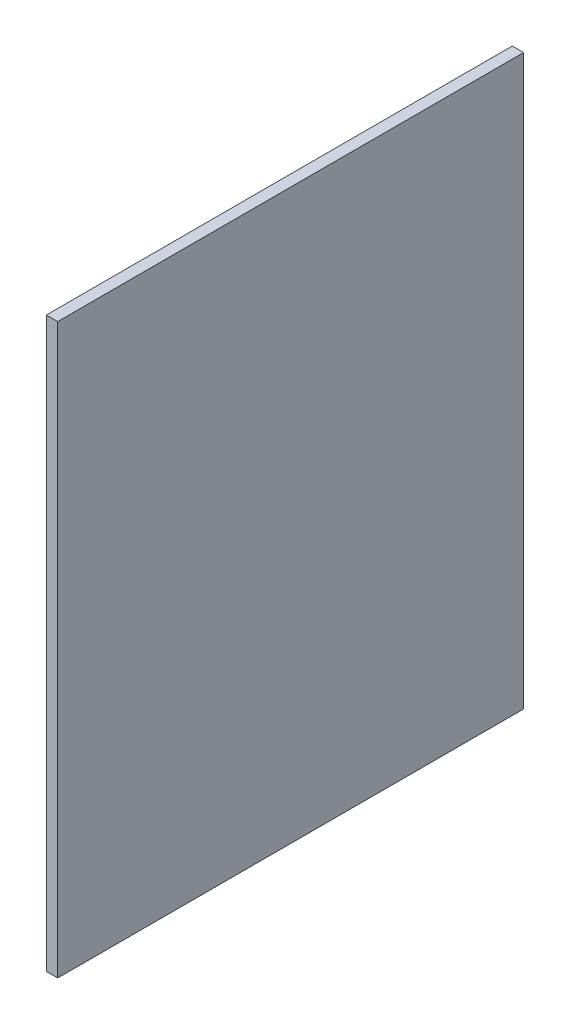
ISO-10303-21;
HEADER;
FILE_DESCRIPTION(('STEP AP214'),'2;1');
FILE_NAME('part.step','',(''),(''),'','','');
FILE_SCHEMA(('AUTOMOTIVE_DESIGN { 1 0 10303 214 1 1 1 1 }'));
ENDSEC;
DATA;
#1=APPLICATION_CONTEXT('core data for automotive mechanical design processes');
#2=APPLICATION_PROTOCOL_DEFINITION('international standard','automotive_design',2000,#1);
#3=PRODUCT_CONTEXT('',#1,'mechanical');
#4=PRODUCT('Part','Part','',(#3));
#5=PRODUCT_RELATED_PRODUCT_CATEGORY('part','',(#4));
#6=PRODUCT_DEFINITION_FORMATION('','',#4);
#7=PRODUCT_DEFINITION_CONTEXT('part definition',#1,'design');
#8=PRODUCT_DEFINITION('design','',#6,#7);
#9=PRODUCT_DEFINITION_SHAPE('','',#8);
#10=(LENGTH_UNIT() NAMED_UNIT(*) SI_UNIT(.MILLI.,.METRE.));
#11=(NAMED_UNIT(*) PLANE_ANGLE_UNIT() SI_UNIT($,.RADIAN.));
#12=(NAMED_UNIT(*) SI_UNIT($,.STERADIAN.) SOLID_ANGLE_UNIT());
#13=UNCERTAINTY_MEASURE_WITH_UNIT(LENGTH_MEASURE(1.E-05),#10,'distance_accuracy_value','');
#14=(GEOMETRIC_REPRESENTATION_CONTEXT(3) GLOBAL_UNCERTAINTY_ASSIGNED_CONTEXT((#13)) GLOBAL_UNIT_ASSIGNED_CONTEXT((#10,
#11,#12)) REPRESENTATION_CONTEXT('',''));
#15=CARTESIAN_POINT('',(0.,0.,0.));
#16=DIRECTION('',(0.,0.,1.));
#17=DIRECTION('',(1.,0.,0.));
#18=AXIS2_PLACEMENT_3D('',#15,#16,#17);
#19=CARTESIAN_POINT('',(8.75,0.,0.));
#20=DIRECTION('',(0.,0.,-1.));
#21=DIRECTION('',(-1.,0.,0.));
#22=AXIS2_PLACEMENT_3D('',#19,#20,#21);
#23=PLANE('',#22);
#24=DIRECTION('',(0.,-1.,0.));
#25=VECTOR('',#24,1.);
#26=CARTESIAN_POINT('',(0.,0.,0.));
#27=LINE('',#26,#25);
#28=CARTESIAN_POINT('',(0.,438.,0.));
#29=VERTEX_POINT('',#28);
#30=CARTESIAN_POINT('',(0.,0.,0.));
#31=VERTEX_POINT('',#30);
#32=EDGE_CURVE('E95',#29,#31,#27,.T.);
#33=ORIENTED_EDGE('',*,*,#32,.T.);
#34=DIRECTION('',(-1.,0.,0.));
#35=VECTOR('',#34,1.);
#36=CARTESIAN_POINT('',(8.75,0.,0.));
#37=LINE('',#36,#35);
#38=CARTESIAN_POINT('',(8.75,0.,0.));
#39=VERTEX_POINT('',#38);
#40=EDGE_CURVE('E11',#39,#31,#37,.T.);
#41=ORIENTED_EDGE('',*,*,#40,.F.);
#42=DIRECTION('',(0.,-1.,0.));
#43=VECTOR('',#42,1.);
#44=CARTESIAN_POINT('',(8.75,0.,0.));
#45=LINE('',#44,#43);
#46=CARTESIAN_POINT('',(8.75,438.,0.));
#47=VERTEX_POINT('',#46);
#48=EDGE_CURVE('E83',#47,#39,#45,.T.);
#49=ORIENTED_EDGE('',*,*,#48,.F.);
#50=DIRECTION('',(-1.,0.,0.));
#51=VECTOR('',#50,1.);
#52=CARTESIAN_POINT('',(8.75,438.,0.));
#53=LINE('',#52,#51);
#54=EDGE_CURVE('E91',#47,#29,#53,.T.);
#55=ORIENTED_EDGE('',*,*,#54,.T.);
#56=EDGE_LOOP('',(#33,#41,#49,#55));
#57=FACE_BOUND('',#56,.T.);
#58=ADVANCED_FACE('F32',(#57),#23,.F.);
#59=CARTESIAN_POINT('',(8.75,0.,0.));
#60=DIRECTION('',(0.,1.,0.));
#61=DIRECTION('',(0.,0.,1.));
#62=AXIS2_PLACEMENT_3D('',#59,#60,#61);
#63=PLANE('',#62);
#64=DIRECTION('',(0.,0.,-1.));
#65=VECTOR('',#64,1.);
#66=CARTESIAN_POINT('',(0.,0.,0.));
#67=LINE('',#66,#65);
#68=CARTESIAN_POINT('',(0.,0.,-359.));
#69=VERTEX_POINT('',#68);
#70=EDGE_CURVE('E87',#31,#69,#67,.T.);
#71=ORIENTED_EDGE('',*,*,#70,.T.);
#72=DIRECTION('',(-1.,0.,0.));
#73=VECTOR('',#72,1.);
#74=CARTESIAN_POINT('',(8.75,0.,-359.));
#75=LINE('',#74,#73);
#76=CARTESIAN_POINT('',(8.75,0.,-359.));
#77=VERTEX_POINT('',#76);
#78=EDGE_CURVE('E40',#77,#69,#75,.T.);
#79=ORIENTED_EDGE('',*,*,#78,.F.);
#80=DIRECTION('',(0.,0.,-1.));
#81=VECTOR('',#80,1.);
#82=CARTESIAN_POINT('',(8.75,0.,0.));
#83=LINE('',#82,#81);
#84=EDGE_CURVE('E78',#39,#77,#83,.T.);
#85=ORIENTED_EDGE('',*,*,#84,.F.);
#86=ORIENTED_EDGE('',*,*,#40,.T.);
#87=EDGE_LOOP('',(#71,#79,#85,#86));
#88=FACE_BOUND('',#87,.T.);
#89=ADVANCED_FACE('F86',(#88),#63,.F.);
#90=CARTESIAN_POINT('',(8.75,0.,-359.));
#91=DIRECTION('',(0.,0.,1.));
#92=DIRECTION('',(1.,0.,0.));
#93=AXIS2_PLACEMENT_3D('',#90,#91,#92);
#94=PLANE('',#93);
#95=DIRECTION('',(0.,1.,0.));
#96=VECTOR('',#95,1.);
#97=CARTESIAN_POINT('',(0.,0.,-359.));
#98=LINE('',#97,#96);
#99=CARTESIAN_POINT('',(0.,438.,-359.));
#100=VERTEX_POINT('',#99);
#101=EDGE_CURVE('E65',#69,#100,#98,.T.);
#102=ORIENTED_EDGE('',*,*,#101,.T.);
#103=DIRECTION('',(-1.,0.,0.));
#104=VECTOR('',#103,1.);
#105=CARTESIAN_POINT('',(8.75,438.,-359.));
#106=LINE('',#105,#104);
#107=CARTESIAN_POINT('',(8.75,438.,-359.));
#108=VERTEX_POINT('',#107);
#109=EDGE_CURVE('E88',#108,#100,#106,.T.);
#110=ORIENTED_EDGE('',*,*,#109,.F.);
#111=DIRECTION('',(0.,1.,0.));
#112=VECTOR('',#111,1.);
#113=CARTESIAN_POINT('',(8.75,0.,-359.));
#114=LINE('',#113,#112);
#115=EDGE_CURVE('E81',#77,#108,#114,.T.);
#116=ORIENTED_EDGE('',*,*,#115,.F.);
#117=ORIENTED_EDGE('',*,*,#78,.T.);
#118=EDGE_LOOP('',(#102,#110,#116,#117));
#119=FACE_BOUND('',#118,.T.);
#120=ADVANCED_FACE('F89',(#119),#94,.F.);
#121=CARTESIAN_POINT('',(8.75,438.,0.));
#122=DIRECTION('',(0.,-1.,0.));
#123=DIRECTION('',(0.,0.,-1.));
#124=AXIS2_PLACEMENT_3D('',#121,#122,#123);
#125=PLANE('',#124);
#126=DIRECTION('',(0.,0.,1.));
#127=VECTOR('',#126,1.);
#128=CARTESIAN_POINT('',(0.,438.,0.));
#129=LINE('',#128,#127);
#130=EDGE_CURVE('E71',#100,#29,#129,.T.);
#131=ORIENTED_EDGE('',*,*,#130,.T.);
#132=ORIENTED_EDGE('',*,*,#54,.F.);
#133=DIRECTION('',(0.,0.,1.));
#134=VECTOR('',#133,1.);
#135=CARTESIAN_POINT('',(8.75,438.,0.));
#136=LINE('',#135,#134);
#137=EDGE_CURVE('E48',#108,#47,#136,.T.);
#138=ORIENTED_EDGE('',*,*,#137,.F.);
#139=ORIENTED_EDGE('',*,*,#109,.T.);
#140=EDGE_LOOP('',(#131,#132,#138,#139));
#141=FACE_BOUND('',#140,.T.);
#142=ADVANCED_FACE('F102',(#141),#125,.F.);
#143=CARTESIAN_POINT('',(8.75,438.,0.));
#144=DIRECTION('',(-1.,0.,0.));
#145=DIRECTION('',(0.,0.,1.));
#146=AXIS2_PLACEMENT_3D('',#143,#144,#145);
#147=PLANE('',#146);
#148=ORIENTED_EDGE('',*,*,#48,.T.);
#149=ORIENTED_EDGE('',*,*,#84,.T.);
#150=ORIENTED_EDGE('',*,*,#115,.T.);
#151=ORIENTED_EDGE('',*,*,#137,.T.);
#152=EDGE_LOOP('',(#148,#149,#150,#151));
#153=FACE_BOUND('',#152,.T.);
#154=ADVANCED_FACE('F79',(#153),#147,.F.);
#155=CARTESIAN_POINT('',(0.,438.,0.));
#156=DIRECTION('',(-1.,0.,0.));
#157=DIRECTION('',(0.,0.,1.));
#158=AXIS2_PLACEMENT_3D('',#155,#156,#157);
#159=PLANE('',#158);
#160=ORIENTED_EDGE('',*,*,#32,.F.);
#161=ORIENTED_EDGE('',*,*,#130,.F.);
#162=ORIENTED_EDGE('',*,*,#101,.F.);
#163=ORIENTED_EDGE('',*,*,#70,.F.);
#164=EDGE_LOOP('',(#160,#161,#162,#163));
#165=FACE_BOUND('',#164,.T.);
#166=ADVANCED_FACE('F105',(#165),#159,.T.);
#167=CLOSED_SHELL('',(#58,#89,#120,#142,#154,#166));
#168=MANIFOLD_SOLID_BREP('B2',#167);
#169=ADVANCED_BREP_SHAPE_REPRESENTATION('',(#18,#168),#14);
#170=SHAPE_DEFINITION_REPRESENTATION(#9,#169);
ENDSEC;
END-ISO-10303-21;
